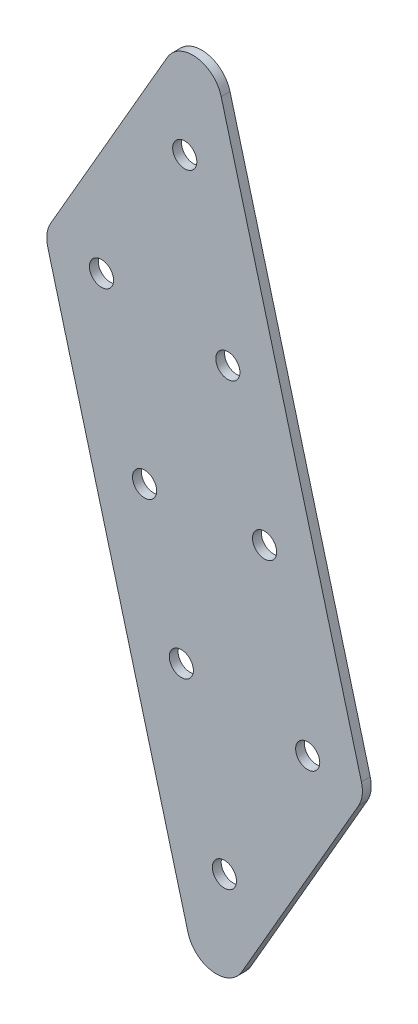
ISO-10303-21;
HEADER;
FILE_DESCRIPTION(('STEP AP214'),'2;1');
FILE_NAME('part.step','',(''),(''),'','','');
FILE_SCHEMA(('AUTOMOTIVE_DESIGN { 1 0 10303 214 1 1 1 1 }'));
ENDSEC;
DATA;
#1=APPLICATION_CONTEXT('core data for automotive mechanical design processes');
#2=APPLICATION_PROTOCOL_DEFINITION('international standard','automotive_design',2000,#1);
#3=PRODUCT_CONTEXT('',#1,'mechanical');
#4=PRODUCT('Part','Part','',(#3));
#5=PRODUCT_RELATED_PRODUCT_CATEGORY('part','',(#4));
#6=PRODUCT_DEFINITION_FORMATION('','',#4);
#7=PRODUCT_DEFINITION_CONTEXT('part definition',#1,'design');
#8=PRODUCT_DEFINITION('design','',#6,#7);
#9=PRODUCT_DEFINITION_SHAPE('','',#8);
#10=(LENGTH_UNIT() NAMED_UNIT(*) SI_UNIT(.MILLI.,.METRE.));
#11=(NAMED_UNIT(*) PLANE_ANGLE_UNIT() SI_UNIT($,.RADIAN.));
#12=(NAMED_UNIT(*) SI_UNIT($,.STERADIAN.) SOLID_ANGLE_UNIT());
#13=UNCERTAINTY_MEASURE_WITH_UNIT(LENGTH_MEASURE(1.E-05),#10,'distance_accuracy_value','');
#14=(GEOMETRIC_REPRESENTATION_CONTEXT(3) GLOBAL_UNCERTAINTY_ASSIGNED_CONTEXT((#13)) GLOBAL_UNIT_ASSIGNED_CONTEXT((#10,
#11,#12)) REPRESENTATION_CONTEXT('',''));
#15=CARTESIAN_POINT('',(0.,0.,0.));
#16=DIRECTION('',(0.,0.,1.));
#17=DIRECTION('',(1.,0.,0.));
#18=AXIS2_PLACEMENT_3D('',#15,#16,#17);
#19=CARTESIAN_POINT('',(121.554429119993,-454.122616553598,3.));
#20=DIRECTION('',(-0.965925826289068,-0.258819045102521,0.));
#21=DIRECTION('',(0.258819045102521,-0.965925826289068,0.));
#22=AXIS2_PLACEMENT_3D('',#19,#20,#21);
#23=PLANE('',#22);
#24=DIRECTION('',(-0.258819045102521,0.965925826289068,0.));
#25=VECTOR('',#24,1.);
#26=CARTESIAN_POINT('',(121.554429119993,-454.122616553598,3.));
#27=LINE('',#26,#25);
#28=CARTESIAN_POINT('',(37.7409989838057,-141.326636928725,3.));
#29=VERTEX_POINT('',#28);
#30=CARTESIAN_POINT('',(-9.87890604825962,36.3932681025472,3.));
#31=VERTEX_POINT('',#30);
#32=EDGE_CURVE('E163',#29,#31,#27,.T.);
#33=ORIENTED_EDGE('',*,*,#32,.F.);
#34=DIRECTION('',(0.,0.,1.));
#35=VECTOR('',#34,1.);
#36=CARTESIAN_POINT('',(37.7409989838057,-141.326636928725,3.));
#37=LINE('',#36,#35);
#38=CARTESIAN_POINT('',(37.7409989838057,-141.326636928725,0.));
#39=VERTEX_POINT('',#38);
#40=EDGE_CURVE('E86',#29,#39,#37,.F.);
#41=ORIENTED_EDGE('',*,*,#40,.T.);
#42=DIRECTION('',(-0.258819045102521,0.965925826289068,0.));
#43=VECTOR('',#42,1.);
#44=CARTESIAN_POINT('',(121.554429119993,-454.122616553598,0.));
#45=LINE('',#44,#43);
#46=CARTESIAN_POINT('',(-9.87890604825962,36.3932681025472,0.));
#47=VERTEX_POINT('',#46);
#48=EDGE_CURVE('E161',#39,#47,#45,.T.);
#49=ORIENTED_EDGE('',*,*,#48,.T.);
#50=DIRECTION('',(0.,0.,1.));
#51=VECTOR('',#50,1.);
#52=CARTESIAN_POINT('',(-9.8789060482596,36.3932681025472,3.));
#53=LINE('',#52,#51);
#54=EDGE_CURVE('E91',#47,#31,#53,.T.);
#55=ORIENTED_EDGE('',*,*,#54,.T.);
#56=EDGE_LOOP('',(#33,#41,#49,#55));
#57=FACE_BOUND('',#56,.T.);
#58=ADVANCED_FACE('F16',(#57),#23,.F.);
#59=CARTESIAN_POINT('',(48.1440663220231,-473.79286398139,3.));
#60=DIRECTION('',(0.965925826289068,0.258819045102521,0.));
#61=DIRECTION('',(-0.258819045102521,0.965925826289068,0.));
#62=AXIS2_PLACEMENT_3D('',#59,#60,#61);
#63=PLANE('',#62);
#64=DIRECTION('',(0.258819045102521,-0.965925826289068,0.));
#65=VECTOR('',#64,1.);
#66=CARTESIAN_POINT('',(48.1440663220231,-473.79286398139,0.));
#67=LINE('',#66,#65);
#68=CARTESIAN_POINT('',(-68.7954023204878,-37.3688255974325,0.));
#69=VERTEX_POINT('',#68);
#70=CARTESIAN_POINT('',(-21.1754972884225,-215.088730628705,0.));
#71=VERTEX_POINT('',#70);
#72=EDGE_CURVE('E166',#69,#71,#67,.T.);
#73=ORIENTED_EDGE('',*,*,#72,.T.);
#74=DIRECTION('',(0.,0.,1.));
#75=VECTOR('',#74,1.);
#76=CARTESIAN_POINT('',(-21.1754972884225,-215.088730628705,3.));
#77=LINE('',#76,#75);
#78=CARTESIAN_POINT('',(-21.1754972884225,-215.088730628705,3.));
#79=VERTEX_POINT('',#78);
#80=EDGE_CURVE('E189',#71,#79,#77,.T.);
#81=ORIENTED_EDGE('',*,*,#80,.T.);
#82=DIRECTION('',(0.258819045102521,-0.965925826289068,0.));
#83=VECTOR('',#82,1.);
#84=CARTESIAN_POINT('',(48.1440663220231,-473.79286398139,3.));
#85=LINE('',#84,#83);
#86=CARTESIAN_POINT('',(-68.7954023204878,-37.3688255974325,3.));
#87=VERTEX_POINT('',#86);
#88=EDGE_CURVE('E165',#87,#79,#85,.T.);
#89=ORIENTED_EDGE('',*,*,#88,.F.);
#90=DIRECTION('',(0.,0.,1.));
#91=VECTOR('',#90,1.);
#92=CARTESIAN_POINT('',(-68.7954023204878,-37.3688255974325,3.));
#93=LINE('',#92,#91);
#94=EDGE_CURVE('E187',#87,#69,#93,.F.);
#95=ORIENTED_EDGE('',*,*,#94,.T.);
#96=EDGE_LOOP('',(#73,#81,#89,#95));
#97=FACE_BOUND('',#96,.T.);
#98=ADVANCED_FACE('F210',(#97),#63,.F.);
#99=CARTESIAN_POINT('',(0.,0.,3.));
#100=DIRECTION('',(0.,0.,-1.));
#101=DIRECTION('',(-1.,0.,0.));
#102=AXIS2_PLACEMENT_3D('',#99,#100,#101);
#103=PLANE('',#102);
#104=CARTESIAN_POINT('',(-22.266815330364,13.07891545011,3.));
#105=DIRECTION('',(0.,0.,1.));
#106=DIRECTION('',(1.,0.,0.));
#107=AXIS2_PLACEMENT_3D('',#104,#105,#106);
#108=CIRCLE('',#107,4.1000000001539);
#109=CARTESIAN_POINT('',(-18.1668153302101,13.07891545011,3.));
#110=VERTEX_POINT('',#109);
#111=EDGE_CURVE('E115',#110,#110,#108,.T.);
#112=ORIENTED_EDGE('',*,*,#111,.F.);
#113=EDGE_LOOP('',(#112));
#114=FACE_BOUND('',#113,.T.);
#115=CARTESIAN_POINT('',(-7.62579917898645,-41.5621007012675,3.));
#116=DIRECTION('',(0.,0.,1.));
#117=DIRECTION('',(1.,0.,0.));
#118=AXIS2_PLACEMENT_3D('',#115,#116,#117);
#119=CIRCLE('',#118,4.10000000015385);
#120=CARTESIAN_POINT('',(-3.5257991788326,-41.5621007012675,3.));
#121=VERTEX_POINT('',#120);
#122=EDGE_CURVE('E121',#121,#121,#119,.T.);
#123=ORIENTED_EDGE('',*,*,#122,.F.);
#124=EDGE_LOOP('',(#123));
#125=FACE_BOUND('',#124,.T.);
#126=CARTESIAN_POINT('',(-50.5510865778259,-35.9108794055535,3.));
#127=DIRECTION('',(0.,0.,1.));
#128=DIRECTION('',(1.,0.,0.));
#129=AXIS2_PLACEMENT_3D('',#126,#127,#128);
#130=CIRCLE('',#129,4.10000000015389);
#131=CARTESIAN_POINT('',(-46.451086577672,-35.9108794055535,3.));
#132=VERTEX_POINT('',#131);
#133=EDGE_CURVE('E127',#132,#132,#130,.T.);
#134=ORIENTED_EDGE('',*,*,#133,.F.);
#135=EDGE_LOOP('',(#134));
#136=FACE_BOUND('',#135,.T.);
#137=CARTESIAN_POINT('',(-35.9100704264483,-90.551895556931,3.));
#138=DIRECTION('',(0.,0.,1.));
#139=DIRECTION('',(1.,0.,0.));
#140=AXIS2_PLACEMENT_3D('',#137,#138,#139);
#141=CIRCLE('',#140,4.10000000015389);
#142=CARTESIAN_POINT('',(-31.8100704262944,-90.551895556931,3.));
#143=VERTEX_POINT('',#142);
#144=EDGE_CURVE('E133',#143,#143,#141,.T.);
#145=ORIENTED_EDGE('',*,*,#144,.F.);
#146=EDGE_LOOP('',(#145));
#147=FACE_BOUND('',#146,.T.);
#148=CARTESIAN_POINT('',(4.85566708977093,-88.1435669692273,3.));
#149=DIRECTION('',(0.,0.,1.));
#150=DIRECTION('',(1.,0.,0.));
#151=AXIS2_PLACEMENT_3D('',#148,#149,#150);
#152=CIRCLE('',#151,4.10000000015387);
#153=CARTESIAN_POINT('',(8.9556670899248,-88.1435669692273,3.));
#154=VERTEX_POINT('',#153);
#155=EDGE_CURVE('E139',#154,#154,#152,.T.);
#156=ORIENTED_EDGE('',*,*,#155,.F.);
#157=EDGE_LOOP('',(#156));
#158=FACE_BOUND('',#157,.T.);
#159=CARTESIAN_POINT('',(19.4966832411485,-142.784583120605,3.));
#160=DIRECTION('',(0.,0.,1.));
#161=DIRECTION('',(1.,0.,0.));
#162=AXIS2_PLACEMENT_3D('',#159,#160,#161);
#163=CIRCLE('',#162,4.10000000015385);
#164=CARTESIAN_POINT('',(23.5966832413023,-142.784583120605,3.));
#165=VERTEX_POINT('',#164);
#166=EDGE_CURVE('E145',#165,#165,#163,.T.);
#167=ORIENTED_EDGE('',*,*,#166,.F.);
#168=EDGE_LOOP('',(#167));
#169=FACE_BOUND('',#168,.T.);
#170=CARTESIAN_POINT('',(-23.4286041576909,-137.133361824891,3.));
#171=DIRECTION('',(0.,0.,1.));
#172=DIRECTION('',(1.,0.,0.));
#173=AXIS2_PLACEMENT_3D('',#170,#171,#172);
#174=CIRCLE('',#173,4.10000000015388);
#175=CARTESIAN_POINT('',(-19.328604157537,-137.133361824891,3.));
#176=VERTEX_POINT('',#175);
#177=EDGE_CURVE('E151',#176,#176,#174,.T.);
#178=ORIENTED_EDGE('',*,*,#177,.F.);
#179=EDGE_LOOP('',(#178));
#180=FACE_BOUND('',#179,.T.);
#181=CARTESIAN_POINT('',(-8.78758800631331,-191.774377976268,3.));
#182=DIRECTION('',(0.,0.,1.));
#183=DIRECTION('',(1.,0.,0.));
#184=AXIS2_PLACEMENT_3D('',#181,#182,#183);
#185=CIRCLE('',#184,4.10000000015384);
#186=CARTESIAN_POINT('',(-4.68758800615947,-191.774377976268,3.));
#187=VERTEX_POINT('',#186);
#188=EDGE_CURVE('E108',#187,#187,#185,.T.);
#189=ORIENTED_EDGE('',*,*,#188,.F.);
#190=EDGE_LOOP('',(#189));
#191=FACE_BOUND('',#190,.T.);
#192=DIRECTION('',(-0.500000000000001,-0.866025403784438,0.));
#193=VECTOR('',#192,1.);
#194=CARTESIAN_POINT('',(-14.9270527995529,-238.40824292944,3.));
#195=LINE('',#194,#193);
#196=CARTESIAN_POINT('',(36.7419947587595,-148.91482737975,3.));
#197=VERTEX_POINT('',#196);
#198=CARTESIAN_POINT('',(-2.85598498768742,-217.50054017768,3.));
#199=VERTEX_POINT('',#198);
#200=EDGE_CURVE('E98',#197,#199,#195,.T.);
#201=ORIENTED_EDGE('',*,*,#200,.F.);
#202=CARTESIAN_POINT('',(28.0817407209151,-143.91482737975,3.));
#203=DIRECTION('',(0.,0.,-1.));
#204=DIRECTION('',(-1.,0.,0.));
#205=AXIS2_PLACEMENT_3D('',#202,#203,#204);
#206=CIRCLE('',#205,10.);
#207=EDGE_CURVE('E81',#197,#29,#206,.F.);
#208=ORIENTED_EDGE('',*,*,#207,.T.);
#209=ORIENTED_EDGE('',*,*,#32,.T.);
#210=CARTESIAN_POINT('',(-19.5381643111503,33.805077651522,3.));
#211=DIRECTION('',(0.,0.,-1.));
#212=DIRECTION('',(-1.,0.,0.));
#213=AXIS2_PLACEMENT_3D('',#210,#211,#212);
#214=CIRCLE('',#213,10.);
#215=CARTESIAN_POINT('',(-28.1984183489947,38.805077651522,3.));
#216=VERTEX_POINT('',#215);
#217=EDGE_CURVE('E174',#31,#216,#214,.F.);
#218=ORIENTED_EDGE('',*,*,#217,.T.);
#219=DIRECTION('',(0.5,0.866025403784439,0.));
#220=VECTOR('',#219,1.);
#221=CARTESIAN_POINT('',(-16.1273505371293,59.7127804032822,3.));
#222=LINE('',#221,#220);
#223=CARTESIAN_POINT('',(-67.7963980954415,-29.7806351464073,3.));
#224=VERTEX_POINT('',#223);
#225=EDGE_CURVE('E114',#224,#216,#222,.T.);
#226=ORIENTED_EDGE('',*,*,#225,.F.);
#227=CARTESIAN_POINT('',(-59.1361440575971,-34.7806351464073,3.));
#228=DIRECTION('',(0.,0.,-1.));
#229=DIRECTION('',(-1.,0.,0.));
#230=AXIS2_PLACEMENT_3D('',#227,#228,#229);
#231=CIRCLE('',#230,10.);
#232=EDGE_CURVE('E102',#224,#87,#231,.F.);
#233=ORIENTED_EDGE('',*,*,#232,.T.);
#234=ORIENTED_EDGE('',*,*,#88,.T.);
#235=CARTESIAN_POINT('',(-11.5162390255318,-212.50054017768,3.));
#236=DIRECTION('',(0.,0.,-1.));
#237=DIRECTION('',(-1.,0.,0.));
#238=AXIS2_PLACEMENT_3D('',#235,#236,#237);
#239=CIRCLE('',#238,10.);
#240=EDGE_CURVE('E92',#79,#199,#239,.F.);
#241=ORIENTED_EDGE('',*,*,#240,.T.);
#242=EDGE_LOOP('',(#201,#208,#209,#218,#226,#233,#234,#241));
#243=FACE_BOUND('',#242,.T.);
#244=ADVANCED_FACE('F105',(#114,#125,#136,#147,#158,#169,#180,#191,#243),#103,.F.);
#245=CARTESIAN_POINT('',(0.,0.,0.));
#246=DIRECTION('',(0.,0.,-1.));
#247=DIRECTION('',(-1.,0.,0.));
#248=AXIS2_PLACEMENT_3D('',#245,#246,#247);
#249=PLANE('',#248);
#250=ORIENTED_EDGE('',*,*,#48,.F.);
#251=CARTESIAN_POINT('',(28.0817407209151,-143.91482737975,0.));
#252=DIRECTION('',(0.,0.,-1.));
#253=DIRECTION('',(-1.,0.,0.));
#254=AXIS2_PLACEMENT_3D('',#251,#252,#253);
#255=CIRCLE('',#254,10.);
#256=CARTESIAN_POINT('',(36.7419947587595,-148.91482737975,0.));
#257=VERTEX_POINT('',#256);
#258=EDGE_CURVE('E185',#39,#257,#255,.T.);
#259=ORIENTED_EDGE('',*,*,#258,.T.);
#260=DIRECTION('',(-0.500000000000001,-0.866025403784438,0.));
#261=VECTOR('',#260,1.);
#262=CARTESIAN_POINT('',(-14.9270527995529,-238.40824292944,0.));
#263=LINE('',#262,#261);
#264=CARTESIAN_POINT('',(-2.85598498768742,-217.50054017768,0.));
#265=VERTEX_POINT('',#264);
#266=EDGE_CURVE('E101',#257,#265,#263,.T.);
#267=ORIENTED_EDGE('',*,*,#266,.T.);
#268=CARTESIAN_POINT('',(-11.5162390255318,-212.50054017768,0.));
#269=DIRECTION('',(0.,0.,-1.));
#270=DIRECTION('',(-1.,0.,0.));
#271=AXIS2_PLACEMENT_3D('',#268,#269,#270);
#272=CIRCLE('',#271,10.);
#273=EDGE_CURVE('E183',#265,#71,#272,.T.);
#274=ORIENTED_EDGE('',*,*,#273,.T.);
#275=ORIENTED_EDGE('',*,*,#72,.F.);
#276=CARTESIAN_POINT('',(-59.1361440575971,-34.7806351464073,0.));
#277=DIRECTION('',(0.,0.,-1.));
#278=DIRECTION('',(-1.,0.,0.));
#279=AXIS2_PLACEMENT_3D('',#276,#277,#278);
#280=CIRCLE('',#279,10.);
#281=CARTESIAN_POINT('',(-67.7963980954415,-29.7806351464073,0.));
#282=VERTEX_POINT('',#281);
#283=EDGE_CURVE('E36',#69,#282,#280,.T.);
#284=ORIENTED_EDGE('',*,*,#283,.T.);
#285=DIRECTION('',(0.5,0.866025403784439,0.));
#286=VECTOR('',#285,1.);
#287=CARTESIAN_POINT('',(-16.1273505371293,59.7127804032822,0.));
#288=LINE('',#287,#286);
#289=CARTESIAN_POINT('',(-28.1984183489947,38.805077651522,0.));
#290=VERTEX_POINT('',#289);
#291=EDGE_CURVE('E159',#282,#290,#288,.T.);
#292=ORIENTED_EDGE('',*,*,#291,.T.);
#293=CARTESIAN_POINT('',(-19.5381643111503,33.805077651522,0.));
#294=DIRECTION('',(0.,0.,-1.));
#295=DIRECTION('',(-1.,0.,0.));
#296=AXIS2_PLACEMENT_3D('',#293,#294,#295);
#297=CIRCLE('',#296,10.);
#298=EDGE_CURVE('E181',#290,#47,#297,.T.);
#299=ORIENTED_EDGE('',*,*,#298,.T.);
#300=EDGE_LOOP('',(#250,#259,#267,#274,#275,#284,#292,#299));
#301=FACE_BOUND('',#300,.T.);
#302=CARTESIAN_POINT('',(-22.266815330364,13.07891545011,0.));
#303=DIRECTION('',(0.,0.,1.));
#304=DIRECTION('',(1.,0.,0.));
#305=AXIS2_PLACEMENT_3D('',#302,#303,#304);
#306=CIRCLE('',#305,4.1000000001539);
#307=CARTESIAN_POINT('',(-18.1668153302101,13.07891545011,0.));
#308=VERTEX_POINT('',#307);
#309=EDGE_CURVE('E111',#308,#308,#306,.T.);
#310=ORIENTED_EDGE('',*,*,#309,.T.);
#311=EDGE_LOOP('',(#310));
#312=FACE_BOUND('',#311,.T.);
#313=CARTESIAN_POINT('',(-7.62579917898645,-41.5621007012675,0.));
#314=DIRECTION('',(0.,0.,1.));
#315=DIRECTION('',(1.,0.,0.));
#316=AXIS2_PLACEMENT_3D('',#313,#314,#315);
#317=CIRCLE('',#316,4.10000000015385);
#318=CARTESIAN_POINT('',(-3.5257991788326,-41.5621007012675,0.));
#319=VERTEX_POINT('',#318);
#320=EDGE_CURVE('E118',#319,#319,#317,.T.);
#321=ORIENTED_EDGE('',*,*,#320,.T.);
#322=EDGE_LOOP('',(#321));
#323=FACE_BOUND('',#322,.T.);
#324=CARTESIAN_POINT('',(-50.5510865778259,-35.9108794055535,0.));
#325=DIRECTION('',(0.,0.,1.));
#326=DIRECTION('',(1.,0.,0.));
#327=AXIS2_PLACEMENT_3D('',#324,#325,#326);
#328=CIRCLE('',#327,4.10000000015389);
#329=CARTESIAN_POINT('',(-46.451086577672,-35.9108794055535,0.));
#330=VERTEX_POINT('',#329);
#331=EDGE_CURVE('E124',#330,#330,#328,.T.);
#332=ORIENTED_EDGE('',*,*,#331,.T.);
#333=EDGE_LOOP('',(#332));
#334=FACE_BOUND('',#333,.T.);
#335=CARTESIAN_POINT('',(-35.9100704264483,-90.551895556931,0.));
#336=DIRECTION('',(0.,0.,1.));
#337=DIRECTION('',(1.,0.,0.));
#338=AXIS2_PLACEMENT_3D('',#335,#336,#337);
#339=CIRCLE('',#338,4.10000000015389);
#340=CARTESIAN_POINT('',(-31.8100704262944,-90.551895556931,0.));
#341=VERTEX_POINT('',#340);
#342=EDGE_CURVE('E130',#341,#341,#339,.T.);
#343=ORIENTED_EDGE('',*,*,#342,.T.);
#344=EDGE_LOOP('',(#343));
#345=FACE_BOUND('',#344,.T.);
#346=CARTESIAN_POINT('',(4.85566708977093,-88.1435669692273,0.));
#347=DIRECTION('',(0.,0.,1.));
#348=DIRECTION('',(1.,0.,0.));
#349=AXIS2_PLACEMENT_3D('',#346,#347,#348);
#350=CIRCLE('',#349,4.10000000015387);
#351=CARTESIAN_POINT('',(8.9556670899248,-88.1435669692273,0.));
#352=VERTEX_POINT('',#351);
#353=EDGE_CURVE('E136',#352,#352,#350,.T.);
#354=ORIENTED_EDGE('',*,*,#353,.T.);
#355=EDGE_LOOP('',(#354));
#356=FACE_BOUND('',#355,.T.);
#357=CARTESIAN_POINT('',(19.4966832411485,-142.784583120605,0.));
#358=DIRECTION('',(0.,0.,1.));
#359=DIRECTION('',(1.,0.,0.));
#360=AXIS2_PLACEMENT_3D('',#357,#358,#359);
#361=CIRCLE('',#360,4.10000000015385);
#362=CARTESIAN_POINT('',(23.5966832413023,-142.784583120605,0.));
#363=VERTEX_POINT('',#362);
#364=EDGE_CURVE('E142',#363,#363,#361,.T.);
#365=ORIENTED_EDGE('',*,*,#364,.T.);
#366=EDGE_LOOP('',(#365));
#367=FACE_BOUND('',#366,.T.);
#368=CARTESIAN_POINT('',(-23.4286041576909,-137.133361824891,0.));
#369=DIRECTION('',(0.,0.,1.));
#370=DIRECTION('',(1.,0.,0.));
#371=AXIS2_PLACEMENT_3D('',#368,#369,#370);
#372=CIRCLE('',#371,4.10000000015388);
#373=CARTESIAN_POINT('',(-19.328604157537,-137.133361824891,0.));
#374=VERTEX_POINT('',#373);
#375=EDGE_CURVE('E148',#374,#374,#372,.T.);
#376=ORIENTED_EDGE('',*,*,#375,.T.);
#377=EDGE_LOOP('',(#376));
#378=FACE_BOUND('',#377,.T.);
#379=CARTESIAN_POINT('',(-8.78758800631331,-191.774377976268,0.));
#380=DIRECTION('',(0.,0.,1.));
#381=DIRECTION('',(1.,0.,0.));
#382=AXIS2_PLACEMENT_3D('',#379,#380,#381);
#383=CIRCLE('',#382,4.10000000015384);
#384=CARTESIAN_POINT('',(-4.68758800615947,-191.774377976268,0.));
#385=VERTEX_POINT('',#384);
#386=EDGE_CURVE('E154',#385,#385,#383,.T.);
#387=ORIENTED_EDGE('',*,*,#386,.T.);
#388=EDGE_LOOP('',(#387));
#389=FACE_BOUND('',#388,.T.);
#390=ADVANCED_FACE('F203',(#301,#312,#323,#334,#345,#356,#367,#378,#389),#249,.T.);
#391=CARTESIAN_POINT('',(-16.1273505371293,59.7127804032822,0.));
#392=DIRECTION('',(0.866025403784439,-0.5,0.));
#393=DIRECTION('',(0.5,0.866025403784439,0.));
#394=AXIS2_PLACEMENT_3D('',#391,#392,#393);
#395=PLANE('',#394);
#396=ORIENTED_EDGE('',*,*,#225,.T.);
#397=DIRECTION('',(0.,0.,1.));
#398=VECTOR('',#397,1.);
#399=CARTESIAN_POINT('',(-28.1984183489947,38.805077651522,0.));
#400=LINE('',#399,#398);
#401=EDGE_CURVE('E10',#216,#290,#400,.F.);
#402=ORIENTED_EDGE('',*,*,#401,.T.);
#403=ORIENTED_EDGE('',*,*,#291,.F.);
#404=DIRECTION('',(0.,0.,1.));
#405=VECTOR('',#404,1.);
#406=CARTESIAN_POINT('',(-67.7963980954415,-29.7806351464073,0.));
#407=LINE('',#406,#405);
#408=EDGE_CURVE('E24',#282,#224,#407,.T.);
#409=ORIENTED_EDGE('',*,*,#408,.T.);
#410=EDGE_LOOP('',(#396,#402,#403,#409));
#411=FACE_BOUND('',#410,.T.);
#412=ADVANCED_FACE('F194',(#411),#395,.F.);
#413=CARTESIAN_POINT('',(-8.78758800631331,-191.774377976268,0.));
#414=DIRECTION('',(0.,0.,1.));
#415=DIRECTION('',(1.,0.,0.));
#416=AXIS2_PLACEMENT_3D('',#413,#414,#415);
#417=CYLINDRICAL_SURFACE('',#416,4.10000000015384);
#418=ORIENTED_EDGE('',*,*,#386,.F.);
#419=EDGE_LOOP('',(#418));
#420=FACE_BOUND('',#419,.T.);
#421=ORIENTED_EDGE('',*,*,#188,.T.);
#422=EDGE_LOOP('',(#421));
#423=FACE_BOUND('',#422,.T.);
#424=ADVANCED_FACE('F334',(#420,#423),#417,.F.);
#425=CARTESIAN_POINT('',(-23.4286041576909,-137.133361824891,0.));
#426=DIRECTION('',(0.,0.,1.));
#427=DIRECTION('',(1.,0.,0.));
#428=AXIS2_PLACEMENT_3D('',#425,#426,#427);
#429=CYLINDRICAL_SURFACE('',#428,4.10000000015388);
#430=ORIENTED_EDGE('',*,*,#375,.F.);
#431=EDGE_LOOP('',(#430));
#432=FACE_BOUND('',#431,.T.);
#433=ORIENTED_EDGE('',*,*,#177,.T.);
#434=EDGE_LOOP('',(#433));
#435=FACE_BOUND('',#434,.T.);
#436=ADVANCED_FACE('F325',(#432,#435),#429,.F.);
#437=CARTESIAN_POINT('',(19.4966832411485,-142.784583120605,0.));
#438=DIRECTION('',(0.,0.,1.));
#439=DIRECTION('',(1.,0.,0.));
#440=AXIS2_PLACEMENT_3D('',#437,#438,#439);
#441=CYLINDRICAL_SURFACE('',#440,4.10000000015385);
#442=ORIENTED_EDGE('',*,*,#364,.F.);
#443=EDGE_LOOP('',(#442));
#444=FACE_BOUND('',#443,.T.);
#445=ORIENTED_EDGE('',*,*,#166,.T.);
#446=EDGE_LOOP('',(#445));
#447=FACE_BOUND('',#446,.T.);
#448=ADVANCED_FACE('F316',(#444,#447),#441,.F.);
#449=CARTESIAN_POINT('',(4.85566708977093,-88.1435669692273,0.));
#450=DIRECTION('',(0.,0.,1.));
#451=DIRECTION('',(1.,0.,0.));
#452=AXIS2_PLACEMENT_3D('',#449,#450,#451);
#453=CYLINDRICAL_SURFACE('',#452,4.10000000015387);
#454=ORIENTED_EDGE('',*,*,#353,.F.);
#455=EDGE_LOOP('',(#454));
#456=FACE_BOUND('',#455,.T.);
#457=ORIENTED_EDGE('',*,*,#155,.T.);
#458=EDGE_LOOP('',(#457));
#459=FACE_BOUND('',#458,.T.);
#460=ADVANCED_FACE('F307',(#456,#459),#453,.F.);
#461=CARTESIAN_POINT('',(-35.9100704264483,-90.551895556931,0.));
#462=DIRECTION('',(0.,0.,1.));
#463=DIRECTION('',(1.,0.,0.));
#464=AXIS2_PLACEMENT_3D('',#461,#462,#463);
#465=CYLINDRICAL_SURFACE('',#464,4.10000000015389);
#466=ORIENTED_EDGE('',*,*,#342,.F.);
#467=EDGE_LOOP('',(#466));
#468=FACE_BOUND('',#467,.T.);
#469=ORIENTED_EDGE('',*,*,#144,.T.);
#470=EDGE_LOOP('',(#469));
#471=FACE_BOUND('',#470,.T.);
#472=ADVANCED_FACE('F298',(#468,#471),#465,.F.);
#473=CARTESIAN_POINT('',(-50.5510865778259,-35.9108794055535,0.));
#474=DIRECTION('',(0.,0.,1.));
#475=DIRECTION('',(1.,0.,0.));
#476=AXIS2_PLACEMENT_3D('',#473,#474,#475);
#477=CYLINDRICAL_SURFACE('',#476,4.10000000015389);
#478=ORIENTED_EDGE('',*,*,#331,.F.);
#479=EDGE_LOOP('',(#478));
#480=FACE_BOUND('',#479,.T.);
#481=ORIENTED_EDGE('',*,*,#133,.T.);
#482=EDGE_LOOP('',(#481));
#483=FACE_BOUND('',#482,.T.);
#484=ADVANCED_FACE('F289',(#480,#483),#477,.F.);
#485=CARTESIAN_POINT('',(-7.62579917898645,-41.5621007012675,0.));
#486=DIRECTION('',(0.,0.,1.));
#487=DIRECTION('',(1.,0.,0.));
#488=AXIS2_PLACEMENT_3D('',#485,#486,#487);
#489=CYLINDRICAL_SURFACE('',#488,4.10000000015385);
#490=ORIENTED_EDGE('',*,*,#320,.F.);
#491=EDGE_LOOP('',(#490));
#492=FACE_BOUND('',#491,.T.);
#493=ORIENTED_EDGE('',*,*,#122,.T.);
#494=EDGE_LOOP('',(#493));
#495=FACE_BOUND('',#494,.T.);
#496=ADVANCED_FACE('F280',(#492,#495),#489,.F.);
#497=CARTESIAN_POINT('',(-22.266815330364,13.07891545011,0.));
#498=DIRECTION('',(0.,0.,1.));
#499=DIRECTION('',(1.,0.,0.));
#500=AXIS2_PLACEMENT_3D('',#497,#498,#499);
#501=CYLINDRICAL_SURFACE('',#500,4.1000000001539);
#502=ORIENTED_EDGE('',*,*,#309,.F.);
#503=EDGE_LOOP('',(#502));
#504=FACE_BOUND('',#503,.T.);
#505=ORIENTED_EDGE('',*,*,#111,.T.);
#506=EDGE_LOOP('',(#505));
#507=FACE_BOUND('',#506,.T.);
#508=ADVANCED_FACE('F272',(#504,#507),#501,.F.);
#509=CARTESIAN_POINT('',(-14.9270527995529,-238.40824292944,0.));
#510=DIRECTION('',(-0.866025403784438,0.500000000000001,0.));
#511=DIRECTION('',(-0.500000000000001,-0.866025403784438,0.));
#512=AXIS2_PLACEMENT_3D('',#509,#510,#511);
#513=PLANE('',#512);
#514=ORIENTED_EDGE('',*,*,#266,.F.);
#515=DIRECTION('',(0.,0.,1.));
#516=VECTOR('',#515,1.);
#517=CARTESIAN_POINT('',(36.7419947587595,-148.91482737975,0.));
#518=LINE('',#517,#516);
#519=EDGE_CURVE('E85',#257,#197,#518,.T.);
#520=ORIENTED_EDGE('',*,*,#519,.T.);
#521=ORIENTED_EDGE('',*,*,#200,.T.);
#522=DIRECTION('',(0.,0.,1.));
#523=VECTOR('',#522,1.);
#524=CARTESIAN_POINT('',(-2.85598498768742,-217.50054017768,0.));
#525=LINE('',#524,#523);
#526=EDGE_CURVE('E103',#199,#265,#525,.F.);
#527=ORIENTED_EDGE('',*,*,#526,.T.);
#528=EDGE_LOOP('',(#514,#520,#521,#527));
#529=FACE_BOUND('',#528,.T.);
#530=ADVANCED_FACE('F97',(#529),#513,.F.);
#531=CARTESIAN_POINT('',(28.0817407209151,-143.91482737975,0.));
#532=DIRECTION('',(0.,0.,1.));
#533=DIRECTION('',(1.,0.,0.));
#534=AXIS2_PLACEMENT_3D('',#531,#532,#533);
#535=CYLINDRICAL_SURFACE('',#534,10.);
#536=ORIENTED_EDGE('',*,*,#258,.F.);
#537=ORIENTED_EDGE('',*,*,#40,.F.);
#538=ORIENTED_EDGE('',*,*,#207,.F.);
#539=ORIENTED_EDGE('',*,*,#519,.F.);
#540=EDGE_LOOP('',(#536,#537,#538,#539));
#541=FACE_BOUND('',#540,.T.);
#542=ADVANCED_FACE('F84',(#541),#535,.T.);
#543=CARTESIAN_POINT('',(-11.5162390255318,-212.50054017768,3.));
#544=DIRECTION('',(0.,0.,1.));
#545=DIRECTION('',(1.,0.,0.));
#546=AXIS2_PLACEMENT_3D('',#543,#544,#545);
#547=CYLINDRICAL_SURFACE('',#546,10.);
#548=ORIENTED_EDGE('',*,*,#273,.F.);
#549=ORIENTED_EDGE('',*,*,#526,.F.);
#550=ORIENTED_EDGE('',*,*,#240,.F.);
#551=ORIENTED_EDGE('',*,*,#80,.F.);
#552=EDGE_LOOP('',(#548,#549,#550,#551));
#553=FACE_BOUND('',#552,.T.);
#554=ADVANCED_FACE('F208',(#553),#547,.T.);
#555=CARTESIAN_POINT('',(-19.5381643111503,33.805077651522,3.));
#556=DIRECTION('',(0.,0.,1.));
#557=DIRECTION('',(1.,0.,0.));
#558=AXIS2_PLACEMENT_3D('',#555,#556,#557);
#559=CYLINDRICAL_SURFACE('',#558,10.);
#560=ORIENTED_EDGE('',*,*,#298,.F.);
#561=ORIENTED_EDGE('',*,*,#401,.F.);
#562=ORIENTED_EDGE('',*,*,#217,.F.);
#563=ORIENTED_EDGE('',*,*,#54,.F.);
#564=EDGE_LOOP('',(#560,#561,#562,#563));
#565=FACE_BOUND('',#564,.T.);
#566=ADVANCED_FACE('F200',(#565),#559,.T.);
#567=CARTESIAN_POINT('',(-59.1361440575971,-34.7806351464073,0.));
#568=DIRECTION('',(0.,0.,1.));
#569=DIRECTION('',(1.,0.,0.));
#570=AXIS2_PLACEMENT_3D('',#567,#568,#569);
#571=CYLINDRICAL_SURFACE('',#570,10.);
#572=ORIENTED_EDGE('',*,*,#283,.F.);
#573=ORIENTED_EDGE('',*,*,#94,.F.);
#574=ORIENTED_EDGE('',*,*,#232,.F.);
#575=ORIENTED_EDGE('',*,*,#408,.F.);
#576=EDGE_LOOP('',(#572,#573,#574,#575));
#577=FACE_BOUND('',#576,.T.);
#578=ADVANCED_FACE('F18',(#577),#571,.T.);
#579=CLOSED_SHELL('',(#58,#98,#244,#390,#412,#424,#436,#448,#460,#472,#484,#496,#508,#530,#542,
#554,#566,#578));
#580=MANIFOLD_SOLID_BREP('B1',#579);
#581=ADVANCED_BREP_SHAPE_REPRESENTATION('',(#18,#580),#14);
#582=SHAPE_DEFINITION_REPRESENTATION(#9,#581);
ENDSEC;
END-ISO-10303-21;
